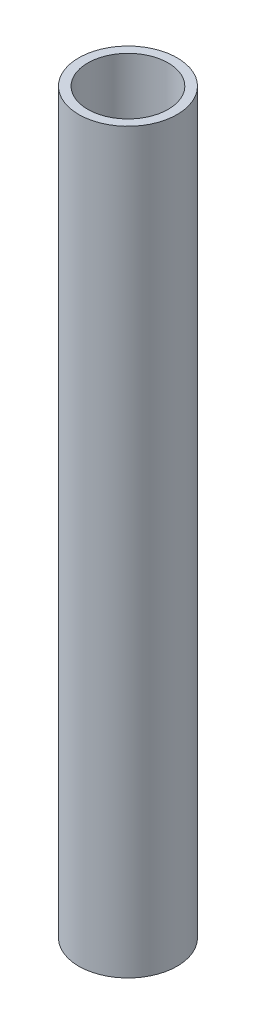
ISO-10303-21;
HEADER;
FILE_DESCRIPTION(('STEP AP214'),'2;1');
FILE_NAME('part.step','',(''),(''),'','','');
FILE_SCHEMA(('AUTOMOTIVE_DESIGN { 1 0 10303 214 1 1 1 1 }'));
ENDSEC;
DATA;
#1=APPLICATION_CONTEXT('core data for automotive mechanical design processes');
#2=APPLICATION_PROTOCOL_DEFINITION('international standard','automotive_design',2000,#1);
#3=PRODUCT_CONTEXT('',#1,'mechanical');
#4=PRODUCT('Part','Part','',(#3));
#5=PRODUCT_RELATED_PRODUCT_CATEGORY('part','',(#4));
#6=PRODUCT_DEFINITION_FORMATION('','',#4);
#7=PRODUCT_DEFINITION_CONTEXT('part definition',#1,'design');
#8=PRODUCT_DEFINITION('design','',#6,#7);
#9=PRODUCT_DEFINITION_SHAPE('','',#8);
#10=(LENGTH_UNIT() NAMED_UNIT(*) SI_UNIT(.MILLI.,.METRE.));
#11=(NAMED_UNIT(*) PLANE_ANGLE_UNIT() SI_UNIT($,.RADIAN.));
#12=(NAMED_UNIT(*) SI_UNIT($,.STERADIAN.) SOLID_ANGLE_UNIT());
#13=UNCERTAINTY_MEASURE_WITH_UNIT(LENGTH_MEASURE(1.E-05),#10,'distance_accuracy_value','');
#14=(GEOMETRIC_REPRESENTATION_CONTEXT(3) GLOBAL_UNCERTAINTY_ASSIGNED_CONTEXT((#13)) GLOBAL_UNIT_ASSIGNED_CONTEXT((#10,
#11,#12)) REPRESENTATION_CONTEXT('',''));
#15=CARTESIAN_POINT('',(0.,0.,0.));
#16=DIRECTION('',(0.,0.,1.));
#17=DIRECTION('',(1.,0.,0.));
#18=AXIS2_PLACEMENT_3D('',#15,#16,#17);
#19=CARTESIAN_POINT('',(0.,165.,0.));
#20=DIRECTION('',(0.,1.,0.));
#21=DIRECTION('',(0.,0.,1.));
#22=AXIS2_PLACEMENT_3D('',#19,#20,#21);
#23=PLANE('',#22);
#24=CARTESIAN_POINT('',(0.,165.,0.));
#25=DIRECTION('',(0.,1.,0.));
#26=DIRECTION('',(0.,0.,1.));
#27=AXIS2_PLACEMENT_3D('',#24,#25,#26);
#28=CIRCLE('',#27,11.);
#29=CARTESIAN_POINT('',(0.,165.,11.));
#30=VERTEX_POINT('',#29);
#31=EDGE_CURVE('E10',#30,#30,#28,.T.);
#32=ORIENTED_EDGE('',*,*,#31,.T.);
#33=EDGE_LOOP('',(#32));
#34=FACE_BOUND('',#33,.T.);
#35=CARTESIAN_POINT('',(0.,165.,0.));
#36=DIRECTION('',(0.,1.,0.));
#37=DIRECTION('',(0.,0.,1.));
#38=AXIS2_PLACEMENT_3D('',#35,#36,#37);
#39=CIRCLE('',#38,9.);
#40=CARTESIAN_POINT('',(0.,165.,9.));
#41=VERTEX_POINT('',#40);
#42=EDGE_CURVE('E41',#41,#41,#39,.T.);
#43=ORIENTED_EDGE('',*,*,#42,.F.);
#44=EDGE_LOOP('',(#43));
#45=FACE_BOUND('',#44,.T.);
#46=ADVANCED_FACE('F30',(#34,#45),#23,.T.);
#47=CARTESIAN_POINT('',(0.,0.,0.));
#48=DIRECTION('',(0.,1.,0.));
#49=DIRECTION('',(0.,0.,1.));
#50=AXIS2_PLACEMENT_3D('',#47,#48,#49);
#51=PLANE('',#50);
#52=CARTESIAN_POINT('',(0.,0.,0.));
#53=DIRECTION('',(0.,1.,0.));
#54=DIRECTION('',(0.,0.,1.));
#55=AXIS2_PLACEMENT_3D('',#52,#53,#54);
#56=CIRCLE('',#55,11.);
#57=CARTESIAN_POINT('',(0.,0.,11.));
#58=VERTEX_POINT('',#57);
#59=EDGE_CURVE('E34',#58,#58,#56,.T.);
#60=ORIENTED_EDGE('',*,*,#59,.F.);
#61=EDGE_LOOP('',(#60));
#62=FACE_BOUND('',#61,.T.);
#63=CARTESIAN_POINT('',(0.,0.,0.));
#64=DIRECTION('',(0.,1.,0.));
#65=DIRECTION('',(0.,0.,1.));
#66=AXIS2_PLACEMENT_3D('',#63,#64,#65);
#67=CIRCLE('',#66,9.);
#68=CARTESIAN_POINT('',(0.,0.,9.));
#69=VERTEX_POINT('',#68);
#70=EDGE_CURVE('E43',#69,#69,#67,.T.);
#71=ORIENTED_EDGE('',*,*,#70,.T.);
#72=EDGE_LOOP('',(#71));
#73=FACE_BOUND('',#72,.T.);
#74=ADVANCED_FACE('F53',(#62,#73),#51,.F.);
#75=CARTESIAN_POINT('',(0.,165.,0.));
#76=DIRECTION('',(0.,-1.,0.));
#77=DIRECTION('',(0.,0.,-1.));
#78=AXIS2_PLACEMENT_3D('',#75,#76,#77);
#79=CYLINDRICAL_SURFACE('',#78,11.);
#80=ORIENTED_EDGE('',*,*,#31,.F.);
#81=EDGE_LOOP('',(#80));
#82=FACE_BOUND('',#81,.T.);
#83=ORIENTED_EDGE('',*,*,#59,.T.);
#84=EDGE_LOOP('',(#83));
#85=FACE_BOUND('',#84,.T.);
#86=ADVANCED_FACE('F32',(#82,#85),#79,.T.);
#87=CARTESIAN_POINT('',(0.,165.,0.));
#88=DIRECTION('',(0.,-1.,0.));
#89=DIRECTION('',(0.,0.,-1.));
#90=AXIS2_PLACEMENT_3D('',#87,#88,#89);
#91=CYLINDRICAL_SURFACE('',#90,9.);
#92=ORIENTED_EDGE('',*,*,#42,.T.);
#93=EDGE_LOOP('',(#92));
#94=FACE_BOUND('',#93,.T.);
#95=ORIENTED_EDGE('',*,*,#70,.F.);
#96=EDGE_LOOP('',(#95));
#97=FACE_BOUND('',#96,.T.);
#98=ADVANCED_FACE('F49',(#94,#97),#91,.F.);
#99=CLOSED_SHELL('',(#46,#74,#86,#98));
#100=MANIFOLD_SOLID_BREP('B2',#99);
#101=ADVANCED_BREP_SHAPE_REPRESENTATION('',(#18,#100),#14);
#102=SHAPE_DEFINITION_REPRESENTATION(#9,#101);
ENDSEC;
END-ISO-10303-21;
